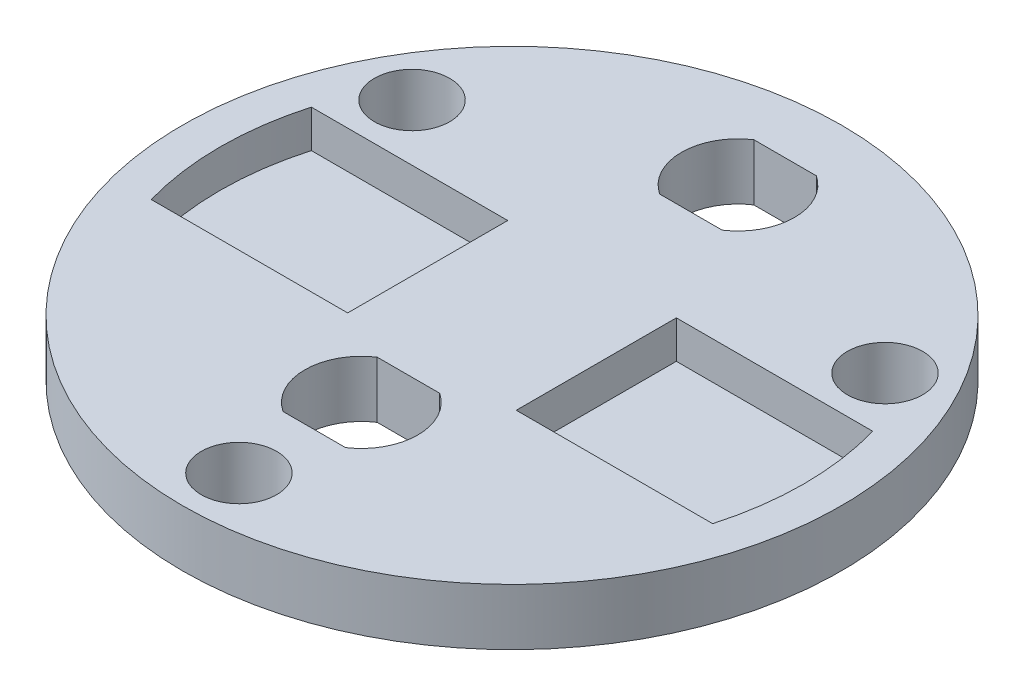
ISO-10303-21;
HEADER;
FILE_DESCRIPTION(('STEP AP214'),'2;1');
FILE_NAME('part.step','',(''),(''),'','','');
FILE_SCHEMA(('AUTOMOTIVE_DESIGN { 1 0 10303 214 1 1 1 1 }'));
ENDSEC;
DATA;
#1=APPLICATION_CONTEXT('core data for automotive mechanical design processes');
#2=APPLICATION_PROTOCOL_DEFINITION('international standard','automotive_design',2000,#1);
#3=PRODUCT_CONTEXT('',#1,'mechanical');
#4=PRODUCT('Part','Part','',(#3));
#5=PRODUCT_RELATED_PRODUCT_CATEGORY('part','',(#4));
#6=PRODUCT_DEFINITION_FORMATION('','',#4);
#7=PRODUCT_DEFINITION_CONTEXT('part definition',#1,'design');
#8=PRODUCT_DEFINITION('design','',#6,#7);
#9=PRODUCT_DEFINITION_SHAPE('','',#8);
#10=(LENGTH_UNIT() NAMED_UNIT(*) SI_UNIT(.MILLI.,.METRE.));
#11=(NAMED_UNIT(*) PLANE_ANGLE_UNIT() SI_UNIT($,.RADIAN.));
#12=(NAMED_UNIT(*) SI_UNIT($,.STERADIAN.) SOLID_ANGLE_UNIT());
#13=UNCERTAINTY_MEASURE_WITH_UNIT(LENGTH_MEASURE(1.E-05),#10,'distance_accuracy_value','');
#14=(GEOMETRIC_REPRESENTATION_CONTEXT(3) GLOBAL_UNCERTAINTY_ASSIGNED_CONTEXT((#13)) GLOBAL_UNIT_ASSIGNED_CONTEXT((#10,
#11,#12)) REPRESENTATION_CONTEXT('',''));
#15=CARTESIAN_POINT('',(0.,0.,0.));
#16=DIRECTION('',(0.,0.,1.));
#17=DIRECTION('',(1.,0.,0.));
#18=AXIS2_PLACEMENT_3D('',#15,#16,#17);
#19=CARTESIAN_POINT('',(0.,3.,0.));
#20=DIRECTION('',(0.,1.,0.));
#21=DIRECTION('',(0.,0.,1.));
#22=AXIS2_PLACEMENT_3D('',#19,#20,#21);
#23=PLANE('',#22);
#24=CARTESIAN_POINT('',(0.,3.,8.));
#25=DIRECTION('',(0.,1.,0.));
#26=DIRECTION('',(0.,0.,1.));
#27=AXIS2_PLACEMENT_3D('',#24,#25,#26);
#28=CIRCLE('',#27,3.);
#29=CARTESIAN_POINT('',(-1.6583123951777,3.,5.5));
#30=VERTEX_POINT('',#29);
#31=CARTESIAN_POINT('',(-1.6583123951777,3.,10.5));
#32=VERTEX_POINT('',#31);
#33=EDGE_CURVE('E150',#30,#32,#28,.T.);
#34=ORIENTED_EDGE('',*,*,#33,.F.);
#35=DIRECTION('',(-1.,0.,0.));
#36=VECTOR('',#35,1.);
#37=CARTESIAN_POINT('',(0.,3.,5.5));
#38=LINE('',#37,#36);
#39=CARTESIAN_POINT('',(1.6583123951777,3.,5.5));
#40=VERTEX_POINT('',#39);
#41=EDGE_CURVE('E169',#40,#30,#38,.T.);
#42=ORIENTED_EDGE('',*,*,#41,.F.);
#43=CARTESIAN_POINT('',(0.,3.,8.));
#44=DIRECTION('',(0.,1.,0.));
#45=DIRECTION('',(0.,0.,1.));
#46=AXIS2_PLACEMENT_3D('',#43,#44,#45);
#47=CIRCLE('',#46,3.);
#48=CARTESIAN_POINT('',(1.6583123951777,3.,10.5));
#49=VERTEX_POINT('',#48);
#50=EDGE_CURVE('E171',#49,#40,#47,.T.);
#51=ORIENTED_EDGE('',*,*,#50,.F.);
#52=DIRECTION('',(1.,0.,0.));
#53=VECTOR('',#52,1.);
#54=CARTESIAN_POINT('',(0.,3.,10.5));
#55=LINE('',#54,#53);
#56=EDGE_CURVE('E177',#32,#49,#55,.T.);
#57=ORIENTED_EDGE('',*,*,#56,.F.);
#58=EDGE_LOOP('',(#34,#42,#51,#57));
#59=FACE_BOUND('',#58,.T.);
#60=CARTESIAN_POINT('',(0.,3.,-12.));
#61=DIRECTION('',(0.,1.,0.));
#62=DIRECTION('',(0.,0.,1.));
#63=AXIS2_PLACEMENT_3D('',#60,#61,#62);
#64=CIRCLE('',#63,3.);
#65=CARTESIAN_POINT('',(-1.6583123951777,3.,-14.5));
#66=VERTEX_POINT('',#65);
#67=CARTESIAN_POINT('',(-1.6583123951777,3.,-9.5));
#68=VERTEX_POINT('',#67);
#69=EDGE_CURVE('E208',#66,#68,#64,.T.);
#70=ORIENTED_EDGE('',*,*,#69,.F.);
#71=DIRECTION('',(-1.,0.,0.));
#72=VECTOR('',#71,1.);
#73=CARTESIAN_POINT('',(0.,3.,-14.5));
#74=LINE('',#73,#72);
#75=CARTESIAN_POINT('',(1.6583123951777,3.,-14.5));
#76=VERTEX_POINT('',#75);
#77=EDGE_CURVE('E194',#76,#66,#74,.T.);
#78=ORIENTED_EDGE('',*,*,#77,.F.);
#79=CARTESIAN_POINT('',(0.,3.,-12.));
#80=DIRECTION('',(0.,1.,0.));
#81=DIRECTION('',(0.,0.,1.));
#82=AXIS2_PLACEMENT_3D('',#79,#80,#81);
#83=CIRCLE('',#82,3.);
#84=CARTESIAN_POINT('',(1.6583123951777,3.,-9.5));
#85=VERTEX_POINT('',#84);
#86=EDGE_CURVE('E202',#85,#76,#83,.T.);
#87=ORIENTED_EDGE('',*,*,#86,.F.);
#88=DIRECTION('',(-1.,0.,0.));
#89=VECTOR('',#88,1.);
#90=CARTESIAN_POINT('',(0.,3.,-9.5));
#91=LINE('',#90,#89);
#92=EDGE_CURVE('E205',#85,#68,#91,.T.);
#93=ORIENTED_EDGE('',*,*,#92,.T.);
#94=EDGE_LOOP('',(#70,#78,#87,#93));
#95=FACE_BOUND('',#94,.T.);
#96=CARTESIAN_POINT('',(12.5573683548743,3.,-7.25000000000006));
#97=DIRECTION('',(0.,-1.,0.));
#98=DIRECTION('',(0.,0.,-1.));
#99=AXIS2_PLACEMENT_3D('',#96,#97,#98);
#100=CIRCLE('',#99,2.);
#101=CARTESIAN_POINT('',(12.5573683548743,3.,-9.25000000000006));
#102=VERTEX_POINT('',#101);
#103=EDGE_CURVE('E210',#102,#102,#100,.T.);
#104=ORIENTED_EDGE('',*,*,#103,.T.);
#105=EDGE_LOOP('',(#104));
#106=FACE_BOUND('',#105,.T.);
#107=CARTESIAN_POINT('',(-12.5573683548743,3.,-7.25000000000006));
#108=DIRECTION('',(0.,-1.,0.));
#109=DIRECTION('',(0.,0.,-1.));
#110=AXIS2_PLACEMENT_3D('',#107,#108,#109);
#111=CIRCLE('',#110,2.);
#112=CARTESIAN_POINT('',(-12.5573683548743,3.,-9.25000000000006));
#113=VERTEX_POINT('',#112);
#114=EDGE_CURVE('E214',#113,#113,#111,.T.);
#115=ORIENTED_EDGE('',*,*,#114,.T.);
#116=EDGE_LOOP('',(#115));
#117=FACE_BOUND('',#116,.T.);
#118=CARTESIAN_POINT('',(0.,3.,14.5));
#119=DIRECTION('',(0.,-1.,0.));
#120=DIRECTION('',(0.,0.,-1.));
#121=AXIS2_PLACEMENT_3D('',#118,#119,#120);
#122=CIRCLE('',#121,2.);
#123=CARTESIAN_POINT('',(0.,3.,12.5));
#124=VERTEX_POINT('',#123);
#125=EDGE_CURVE('E223',#124,#124,#122,.T.);
#126=ORIENTED_EDGE('',*,*,#125,.T.);
#127=EDGE_LOOP('',(#126));
#128=FACE_BOUND('',#127,.T.);
#129=CARTESIAN_POINT('',(0.,3.,0.));
#130=DIRECTION('',(0.,1.,0.));
#131=DIRECTION('',(0.,0.,1.));
#132=AXIS2_PLACEMENT_3D('',#129,#130,#131);
#133=CIRCLE('',#132,15.5);
#134=CARTESIAN_POINT('',(-14.9059551857639,3.,-4.25));
#135=VERTEX_POINT('',#134);
#136=CARTESIAN_POINT('',(-14.9059551857639,3.,4.25));
#137=VERTEX_POINT('',#136);
#138=EDGE_CURVE('E277',#135,#137,#133,.T.);
#139=ORIENTED_EDGE('',*,*,#138,.F.);
#140=DIRECTION('',(1.,0.,0.));
#141=VECTOR('',#140,1.);
#142=CARTESIAN_POINT('',(0.,3.,-4.25));
#143=LINE('',#142,#141);
#144=CARTESIAN_POINT('',(-4.47608612136497,3.,-4.25));
#145=VERTEX_POINT('',#144);
#146=EDGE_CURVE('E255',#135,#145,#143,.T.);
#147=ORIENTED_EDGE('',*,*,#146,.T.);
#148=DIRECTION('',(0.,0.,-1.));
#149=VECTOR('',#148,1.);
#150=CARTESIAN_POINT('',(-4.47608612136497,3.,0.));
#151=LINE('',#150,#149);
#152=CARTESIAN_POINT('',(-4.47608612136497,3.,4.25));
#153=VERTEX_POINT('',#152);
#154=EDGE_CURVE('E265',#153,#145,#151,.T.);
#155=ORIENTED_EDGE('',*,*,#154,.F.);
#156=DIRECTION('',(1.,0.,0.));
#157=VECTOR('',#156,1.);
#158=CARTESIAN_POINT('',(0.,3.,4.25));
#159=LINE('',#158,#157);
#160=EDGE_CURVE('E280',#137,#153,#159,.T.);
#161=ORIENTED_EDGE('',*,*,#160,.F.);
#162=EDGE_LOOP('',(#139,#147,#155,#161));
#163=FACE_BOUND('',#162,.T.);
#164=CARTESIAN_POINT('',(0.,3.,0.));
#165=DIRECTION('',(0.,1.,0.));
#166=DIRECTION('',(0.,0.,1.));
#167=AXIS2_PLACEMENT_3D('',#164,#165,#166);
#168=CIRCLE('',#167,17.5);
#169=CARTESIAN_POINT('',(0.,3.,17.5));
#170=VERTEX_POINT('',#169);
#171=EDGE_CURVE('E11',#170,#170,#168,.T.);
#172=ORIENTED_EDGE('',*,*,#171,.T.);
#173=EDGE_LOOP('',(#172));
#174=FACE_BOUND('',#173,.T.);
#175=CARTESIAN_POINT('',(0.,3.,0.));
#176=DIRECTION('',(0.,1.,0.));
#177=DIRECTION('',(0.,0.,1.));
#178=AXIS2_PLACEMENT_3D('',#175,#176,#177);
#179=CIRCLE('',#178,15.5);
#180=CARTESIAN_POINT('',(14.9059551857639,3.,4.25));
#181=VERTEX_POINT('',#180);
#182=CARTESIAN_POINT('',(14.9059551857639,3.,-4.25));
#183=VERTEX_POINT('',#182);
#184=EDGE_CURVE('E244',#181,#183,#179,.T.);
#185=ORIENTED_EDGE('',*,*,#184,.F.);
#186=DIRECTION('',(-1.,0.,0.));
#187=VECTOR('',#186,1.);
#188=CARTESIAN_POINT('',(0.,3.,4.25));
#189=LINE('',#188,#187);
#190=CARTESIAN_POINT('',(4.47608612136497,3.,4.25));
#191=VERTEX_POINT('',#190);
#192=EDGE_CURVE('E226',#181,#191,#189,.T.);
#193=ORIENTED_EDGE('',*,*,#192,.T.);
#194=DIRECTION('',(0.,0.,-1.));
#195=VECTOR('',#194,1.);
#196=CARTESIAN_POINT('',(4.47608612136497,3.,0.));
#197=LINE('',#196,#195);
#198=CARTESIAN_POINT('',(4.47608612136497,3.,-4.25));
#199=VERTEX_POINT('',#198);
#200=EDGE_CURVE('E233',#191,#199,#197,.T.);
#201=ORIENTED_EDGE('',*,*,#200,.T.);
#202=DIRECTION('',(-1.,0.,0.));
#203=VECTOR('',#202,1.);
#204=CARTESIAN_POINT('',(0.,3.,-4.25));
#205=LINE('',#204,#203);
#206=EDGE_CURVE('E247',#183,#199,#205,.T.);
#207=ORIENTED_EDGE('',*,*,#206,.F.);
#208=EDGE_LOOP('',(#185,#193,#201,#207));
#209=FACE_BOUND('',#208,.T.);
#210=ADVANCED_FACE('F34',(#59,#95,#106,#117,#128,#163,#174,#209),#23,.T.);
#211=CARTESIAN_POINT('',(0.,3.,0.));
#212=DIRECTION('',(0.,-1.,0.));
#213=DIRECTION('',(0.,0.,-1.));
#214=AXIS2_PLACEMENT_3D('',#211,#212,#213);
#215=CYLINDRICAL_SURFACE('',#214,17.5);
#216=ORIENTED_EDGE('',*,*,#171,.F.);
#217=EDGE_LOOP('',(#216));
#218=FACE_BOUND('',#217,.T.);
#219=CARTESIAN_POINT('',(0.,0.,0.));
#220=DIRECTION('',(0.,1.,0.));
#221=DIRECTION('',(0.,0.,1.));
#222=AXIS2_PLACEMENT_3D('',#219,#220,#221);
#223=CIRCLE('',#222,17.5);
#224=CARTESIAN_POINT('',(0.,0.,17.5));
#225=VERTEX_POINT('',#224);
#226=EDGE_CURVE('E38',#225,#225,#223,.T.);
#227=ORIENTED_EDGE('',*,*,#226,.T.);
#228=EDGE_LOOP('',(#227));
#229=FACE_BOUND('',#228,.T.);
#230=ADVANCED_FACE('F36',(#218,#229),#215,.T.);
#231=CARTESIAN_POINT('',(0.,0.,0.));
#232=DIRECTION('',(0.,1.,0.));
#233=DIRECTION('',(0.,0.,1.));
#234=AXIS2_PLACEMENT_3D('',#231,#232,#233);
#235=PLANE('',#234);
#236=DIRECTION('',(1.,0.,0.));
#237=VECTOR('',#236,1.);
#238=CARTESIAN_POINT('',(-1.6583123951777,0.,5.5));
#239=LINE('',#238,#237);
#240=CARTESIAN_POINT('',(-1.6583123951777,0.,5.5));
#241=VERTEX_POINT('',#240);
#242=CARTESIAN_POINT('',(1.6583123951777,0.,5.5));
#243=VERTEX_POINT('',#242);
#244=EDGE_CURVE('E168',#241,#243,#239,.T.);
#245=ORIENTED_EDGE('',*,*,#244,.F.);
#246=CARTESIAN_POINT('',(0.,0.,8.));
#247=DIRECTION('',(0.,-1.,0.));
#248=DIRECTION('',(0.,0.,-1.));
#249=AXIS2_PLACEMENT_3D('',#246,#247,#248);
#250=CIRCLE('',#249,3.);
#251=CARTESIAN_POINT('',(-1.6583123951777,0.,10.5));
#252=VERTEX_POINT('',#251);
#253=EDGE_CURVE('E57',#252,#241,#250,.T.);
#254=ORIENTED_EDGE('',*,*,#253,.F.);
#255=DIRECTION('',(-1.,0.,0.));
#256=VECTOR('',#255,1.);
#257=CARTESIAN_POINT('',(1.6583123951777,0.,10.5));
#258=LINE('',#257,#256);
#259=CARTESIAN_POINT('',(1.6583123951777,0.,10.5));
#260=VERTEX_POINT('',#259);
#261=EDGE_CURVE('E156',#260,#252,#258,.T.);
#262=ORIENTED_EDGE('',*,*,#261,.F.);
#263=CARTESIAN_POINT('',(0.,0.,8.));
#264=DIRECTION('',(0.,-1.,0.));
#265=DIRECTION('',(0.,0.,-1.));
#266=AXIS2_PLACEMENT_3D('',#263,#264,#265);
#267=CIRCLE('',#266,3.);
#268=EDGE_CURVE('E162',#243,#260,#267,.T.);
#269=ORIENTED_EDGE('',*,*,#268,.F.);
#270=EDGE_LOOP('',(#245,#254,#262,#269));
#271=FACE_BOUND('',#270,.T.);
#272=DIRECTION('',(1.,0.,0.));
#273=VECTOR('',#272,1.);
#274=CARTESIAN_POINT('',(-1.6583123951777,0.,-14.5));
#275=LINE('',#274,#273);
#276=CARTESIAN_POINT('',(-1.6583123951777,0.,-14.5));
#277=VERTEX_POINT('',#276);
#278=CARTESIAN_POINT('',(1.6583123951777,0.,-14.5));
#279=VERTEX_POINT('',#278);
#280=EDGE_CURVE('E182',#277,#279,#275,.T.);
#281=ORIENTED_EDGE('',*,*,#280,.F.);
#282=CARTESIAN_POINT('',(0.,0.,-12.));
#283=DIRECTION('',(0.,-1.,0.));
#284=DIRECTION('',(0.,0.,-1.));
#285=AXIS2_PLACEMENT_3D('',#282,#283,#284);
#286=CIRCLE('',#285,3.);
#287=CARTESIAN_POINT('',(-1.6583123951777,0.,-9.5));
#288=VERTEX_POINT('',#287);
#289=EDGE_CURVE('E180',#288,#277,#286,.T.);
#290=ORIENTED_EDGE('',*,*,#289,.F.);
#291=DIRECTION('',(1.,0.,0.));
#292=VECTOR('',#291,1.);
#293=CARTESIAN_POINT('',(-1.6583123951777,0.,-9.5));
#294=LINE('',#293,#292);
#295=CARTESIAN_POINT('',(1.6583123951777,0.,-9.5));
#296=VERTEX_POINT('',#295);
#297=EDGE_CURVE('E188',#288,#296,#294,.T.);
#298=ORIENTED_EDGE('',*,*,#297,.T.);
#299=CARTESIAN_POINT('',(0.,0.,-12.));
#300=DIRECTION('',(0.,-1.,0.));
#301=DIRECTION('',(0.,0.,-1.));
#302=AXIS2_PLACEMENT_3D('',#299,#300,#301);
#303=CIRCLE('',#302,3.);
#304=EDGE_CURVE('E185',#279,#296,#303,.T.);
#305=ORIENTED_EDGE('',*,*,#304,.F.);
#306=EDGE_LOOP('',(#281,#290,#298,#305));
#307=FACE_BOUND('',#306,.T.);
#308=CARTESIAN_POINT('',(12.5573683548743,0.,-7.25000000000006));
#309=DIRECTION('',(0.,-1.,0.));
#310=DIRECTION('',(0.,0.,-1.));
#311=AXIS2_PLACEMENT_3D('',#308,#309,#310);
#312=CIRCLE('',#311,2.);
#313=CARTESIAN_POINT('',(12.5573683548743,0.,-9.25000000000006));
#314=VERTEX_POINT('',#313);
#315=EDGE_CURVE('E211',#314,#314,#312,.T.);
#316=ORIENTED_EDGE('',*,*,#315,.F.);
#317=EDGE_LOOP('',(#316));
#318=FACE_BOUND('',#317,.T.);
#319=CARTESIAN_POINT('',(-12.5573683548743,0.,-7.25000000000006));
#320=DIRECTION('',(0.,-1.,0.));
#321=DIRECTION('',(0.,0.,-1.));
#322=AXIS2_PLACEMENT_3D('',#319,#320,#321);
#323=CIRCLE('',#322,2.);
#324=CARTESIAN_POINT('',(-12.5573683548743,0.,-9.25000000000006));
#325=VERTEX_POINT('',#324);
#326=EDGE_CURVE('E217',#325,#325,#323,.T.);
#327=ORIENTED_EDGE('',*,*,#326,.F.);
#328=EDGE_LOOP('',(#327));
#329=FACE_BOUND('',#328,.T.);
#330=CARTESIAN_POINT('',(0.,0.,14.5));
#331=DIRECTION('',(0.,-1.,0.));
#332=DIRECTION('',(0.,0.,-1.));
#333=AXIS2_PLACEMENT_3D('',#330,#331,#332);
#334=CIRCLE('',#333,2.);
#335=CARTESIAN_POINT('',(0.,0.,12.5));
#336=VERTEX_POINT('',#335);
#337=EDGE_CURVE('E220',#336,#336,#334,.T.);
#338=ORIENTED_EDGE('',*,*,#337,.F.);
#339=EDGE_LOOP('',(#338));
#340=FACE_BOUND('',#339,.T.);
#341=ORIENTED_EDGE('',*,*,#226,.F.);
#342=EDGE_LOOP('',(#341));
#343=FACE_BOUND('',#342,.T.);
#344=ADVANCED_FACE('F166',(#271,#307,#318,#329,#340,#343),#235,.F.);
#345=CARTESIAN_POINT('',(0.,1.,-4.25));
#346=DIRECTION('',(0.,0.,1.));
#347=DIRECTION('',(1.,0.,0.));
#348=AXIS2_PLACEMENT_3D('',#345,#346,#347);
#349=PLANE('',#348);
#350=ORIENTED_EDGE('',*,*,#146,.F.);
#351=DIRECTION('',(0.,1.,0.));
#352=VECTOR('',#351,1.);
#353=CARTESIAN_POINT('',(-14.9059551857639,1.,-4.25));
#354=LINE('',#353,#352);
#355=CARTESIAN_POINT('',(-14.9059551857639,1.,-4.25));
#356=VERTEX_POINT('',#355);
#357=EDGE_CURVE('E274',#356,#135,#354,.T.);
#358=ORIENTED_EDGE('',*,*,#357,.F.);
#359=DIRECTION('',(1.,0.,0.));
#360=VECTOR('',#359,1.);
#361=CARTESIAN_POINT('',(0.,1.,-4.25));
#362=LINE('',#361,#360);
#363=CARTESIAN_POINT('',(-4.47608612136497,1.,-4.25));
#364=VERTEX_POINT('',#363);
#365=EDGE_CURVE('E262',#356,#364,#362,.T.);
#366=ORIENTED_EDGE('',*,*,#365,.T.);
#367=DIRECTION('',(0.,1.,0.));
#368=VECTOR('',#367,1.);
#369=CARTESIAN_POINT('',(-4.47608612136497,1.,-4.25));
#370=LINE('',#369,#368);
#371=EDGE_CURVE('E285',#364,#145,#370,.T.);
#372=ORIENTED_EDGE('',*,*,#371,.T.);
#373=EDGE_LOOP('',(#350,#358,#366,#372));
#374=FACE_BOUND('',#373,.T.);
#375=ADVANCED_FACE('F309',(#374),#349,.T.);
#376=CARTESIAN_POINT('',(-4.47608612136497,1.,0.));
#377=DIRECTION('',(1.,0.,0.));
#378=DIRECTION('',(0.,0.,-1.));
#379=AXIS2_PLACEMENT_3D('',#376,#377,#378);
#380=PLANE('',#379);
#381=ORIENTED_EDGE('',*,*,#154,.T.);
#382=ORIENTED_EDGE('',*,*,#371,.F.);
#383=DIRECTION('',(0.,0.,-1.));
#384=VECTOR('',#383,1.);
#385=CARTESIAN_POINT('',(-4.47608612136497,1.,0.));
#386=LINE('',#385,#384);
#387=CARTESIAN_POINT('',(-4.47608612136497,1.,4.25));
#388=VERTEX_POINT('',#387);
#389=EDGE_CURVE('E271',#388,#364,#386,.T.);
#390=ORIENTED_EDGE('',*,*,#389,.F.);
#391=DIRECTION('',(0.,1.,0.));
#392=VECTOR('',#391,1.);
#393=CARTESIAN_POINT('',(-4.47608612136497,1.,4.25));
#394=LINE('',#393,#392);
#395=EDGE_CURVE('E287',#388,#153,#394,.T.);
#396=ORIENTED_EDGE('',*,*,#395,.T.);
#397=EDGE_LOOP('',(#381,#382,#390,#396));
#398=FACE_BOUND('',#397,.T.);
#399=ADVANCED_FACE('F311',(#398),#380,.F.);
#400=CARTESIAN_POINT('',(0.,1.,4.25));
#401=DIRECTION('',(0.,0.,1.));
#402=DIRECTION('',(1.,0.,0.));
#403=AXIS2_PLACEMENT_3D('',#400,#401,#402);
#404=PLANE('',#403);
#405=ORIENTED_EDGE('',*,*,#160,.T.);
#406=ORIENTED_EDGE('',*,*,#395,.F.);
#407=DIRECTION('',(1.,0.,0.));
#408=VECTOR('',#407,1.);
#409=CARTESIAN_POINT('',(0.,1.,4.25));
#410=LINE('',#409,#408);
#411=CARTESIAN_POINT('',(-14.9059551857639,1.,4.25));
#412=VERTEX_POINT('',#411);
#413=EDGE_CURVE('E268',#412,#388,#410,.T.);
#414=ORIENTED_EDGE('',*,*,#413,.F.);
#415=DIRECTION('',(0.,1.,0.));
#416=VECTOR('',#415,1.);
#417=CARTESIAN_POINT('',(-14.9059551857639,1.,4.25));
#418=LINE('',#417,#416);
#419=EDGE_CURVE('E289',#412,#137,#418,.T.);
#420=ORIENTED_EDGE('',*,*,#419,.T.);
#421=EDGE_LOOP('',(#405,#406,#414,#420));
#422=FACE_BOUND('',#421,.T.);
#423=ADVANCED_FACE('F303',(#422),#404,.F.);
#424=CARTESIAN_POINT('',(0.,1.,0.));
#425=DIRECTION('',(0.,1.,0.));
#426=DIRECTION('',(0.,0.,1.));
#427=AXIS2_PLACEMENT_3D('',#424,#425,#426);
#428=CYLINDRICAL_SURFACE('',#427,15.5);
#429=ORIENTED_EDGE('',*,*,#138,.T.);
#430=ORIENTED_EDGE('',*,*,#419,.F.);
#431=CARTESIAN_POINT('',(0.,1.,0.));
#432=DIRECTION('',(0.,1.,0.));
#433=DIRECTION('',(0.,0.,1.));
#434=AXIS2_PLACEMENT_3D('',#431,#432,#433);
#435=CIRCLE('',#434,15.5);
#436=EDGE_CURVE('E264',#356,#412,#435,.T.);
#437=ORIENTED_EDGE('',*,*,#436,.F.);
#438=ORIENTED_EDGE('',*,*,#357,.T.);
#439=EDGE_LOOP('',(#429,#430,#437,#438));
#440=FACE_BOUND('',#439,.T.);
#441=ADVANCED_FACE('F295',(#440),#428,.F.);
#442=CARTESIAN_POINT('',(0.,1.,0.));
#443=DIRECTION('',(0.,1.,0.));
#444=DIRECTION('',(0.,0.,1.));
#445=AXIS2_PLACEMENT_3D('',#442,#443,#444);
#446=PLANE('',#445);
#447=ORIENTED_EDGE('',*,*,#365,.F.);
#448=ORIENTED_EDGE('',*,*,#436,.T.);
#449=ORIENTED_EDGE('',*,*,#413,.T.);
#450=ORIENTED_EDGE('',*,*,#389,.T.);
#451=EDGE_LOOP('',(#447,#448,#449,#450));
#452=FACE_BOUND('',#451,.T.);
#453=ADVANCED_FACE('F307',(#452),#446,.T.);
#454=CARTESIAN_POINT('',(0.,1.,4.25));
#455=DIRECTION('',(0.,0.,-1.));
#456=DIRECTION('',(-1.,0.,0.));
#457=AXIS2_PLACEMENT_3D('',#454,#455,#456);
#458=PLANE('',#457);
#459=ORIENTED_EDGE('',*,*,#192,.F.);
#460=DIRECTION('',(0.,1.,0.));
#461=VECTOR('',#460,1.);
#462=CARTESIAN_POINT('',(14.9059551857639,1.,4.25));
#463=LINE('',#462,#461);
#464=CARTESIAN_POINT('',(14.9059551857639,1.,4.25));
#465=VERTEX_POINT('',#464);
#466=EDGE_CURVE('E241',#465,#181,#463,.T.);
#467=ORIENTED_EDGE('',*,*,#466,.F.);
#468=DIRECTION('',(-1.,0.,0.));
#469=VECTOR('',#468,1.);
#470=CARTESIAN_POINT('',(0.,1.,4.25));
#471=LINE('',#470,#469);
#472=CARTESIAN_POINT('',(4.47608612136497,1.,4.25));
#473=VERTEX_POINT('',#472);
#474=EDGE_CURVE('E229',#465,#473,#471,.T.);
#475=ORIENTED_EDGE('',*,*,#474,.T.);
#476=DIRECTION('',(0.,1.,0.));
#477=VECTOR('',#476,1.);
#478=CARTESIAN_POINT('',(4.47608612136497,1.,4.25));
#479=LINE('',#478,#477);
#480=EDGE_CURVE('E252',#473,#191,#479,.T.);
#481=ORIENTED_EDGE('',*,*,#480,.T.);
#482=EDGE_LOOP('',(#459,#467,#475,#481));
#483=FACE_BOUND('',#482,.T.);
#484=ADVANCED_FACE('F370',(#483),#458,.T.);
#485=CARTESIAN_POINT('',(4.47608612136497,1.,0.));
#486=DIRECTION('',(1.,0.,0.));
#487=DIRECTION('',(0.,0.,-1.));
#488=AXIS2_PLACEMENT_3D('',#485,#486,#487);
#489=PLANE('',#488);
#490=ORIENTED_EDGE('',*,*,#200,.F.);
#491=ORIENTED_EDGE('',*,*,#480,.F.);
#492=DIRECTION('',(0.,0.,-1.));
#493=VECTOR('',#492,1.);
#494=CARTESIAN_POINT('',(4.47608612136497,1.,0.));
#495=LINE('',#494,#493);
#496=CARTESIAN_POINT('',(4.47608612136497,1.,-4.25));
#497=VERTEX_POINT('',#496);
#498=EDGE_CURVE('E239',#473,#497,#495,.T.);
#499=ORIENTED_EDGE('',*,*,#498,.T.);
#500=DIRECTION('',(0.,1.,0.));
#501=VECTOR('',#500,1.);
#502=CARTESIAN_POINT('',(4.47608612136497,1.,-4.25));
#503=LINE('',#502,#501);
#504=EDGE_CURVE('E256',#497,#199,#503,.T.);
#505=ORIENTED_EDGE('',*,*,#504,.T.);
#506=EDGE_LOOP('',(#490,#491,#499,#505));
#507=FACE_BOUND('',#506,.T.);
#508=ADVANCED_FACE('F378',(#507),#489,.T.);
#509=CARTESIAN_POINT('',(0.,1.,-4.25));
#510=DIRECTION('',(0.,0.,-1.));
#511=DIRECTION('',(-1.,0.,0.));
#512=AXIS2_PLACEMENT_3D('',#509,#510,#511);
#513=PLANE('',#512);
#514=ORIENTED_EDGE('',*,*,#206,.T.);
#515=ORIENTED_EDGE('',*,*,#504,.F.);
#516=DIRECTION('',(-1.,0.,0.));
#517=VECTOR('',#516,1.);
#518=CARTESIAN_POINT('',(0.,1.,-4.25));
#519=LINE('',#518,#517);
#520=CARTESIAN_POINT('',(14.9059551857639,1.,-4.25));
#521=VERTEX_POINT('',#520);
#522=EDGE_CURVE('E236',#521,#497,#519,.T.);
#523=ORIENTED_EDGE('',*,*,#522,.F.);
#524=DIRECTION('',(0.,1.,0.));
#525=VECTOR('',#524,1.);
#526=CARTESIAN_POINT('',(14.9059551857639,1.,-4.25));
#527=LINE('',#526,#525);
#528=EDGE_CURVE('E258',#521,#183,#527,.T.);
#529=ORIENTED_EDGE('',*,*,#528,.T.);
#530=EDGE_LOOP('',(#514,#515,#523,#529));
#531=FACE_BOUND('',#530,.T.);
#532=ADVANCED_FACE('F388',(#531),#513,.F.);
#533=CARTESIAN_POINT('',(0.,1.,0.));
#534=DIRECTION('',(0.,1.,0.));
#535=DIRECTION('',(0.,0.,1.));
#536=AXIS2_PLACEMENT_3D('',#533,#534,#535);
#537=CYLINDRICAL_SURFACE('',#536,15.5);
#538=ORIENTED_EDGE('',*,*,#184,.T.);
#539=ORIENTED_EDGE('',*,*,#528,.F.);
#540=CARTESIAN_POINT('',(0.,1.,0.));
#541=DIRECTION('',(0.,1.,0.));
#542=DIRECTION('',(0.,0.,1.));
#543=AXIS2_PLACEMENT_3D('',#540,#541,#542);
#544=CIRCLE('',#543,15.5);
#545=EDGE_CURVE('E232',#465,#521,#544,.T.);
#546=ORIENTED_EDGE('',*,*,#545,.F.);
#547=ORIENTED_EDGE('',*,*,#466,.T.);
#548=EDGE_LOOP('',(#538,#539,#546,#547));
#549=FACE_BOUND('',#548,.T.);
#550=ADVANCED_FACE('F398',(#549),#537,.F.);
#551=CARTESIAN_POINT('',(0.,1.,0.));
#552=DIRECTION('',(0.,1.,0.));
#553=DIRECTION('',(0.,0.,1.));
#554=AXIS2_PLACEMENT_3D('',#551,#552,#553);
#555=PLANE('',#554);
#556=ORIENTED_EDGE('',*,*,#474,.F.);
#557=ORIENTED_EDGE('',*,*,#545,.T.);
#558=ORIENTED_EDGE('',*,*,#522,.T.);
#559=ORIENTED_EDGE('',*,*,#498,.F.);
#560=EDGE_LOOP('',(#556,#557,#558,#559));
#561=FACE_BOUND('',#560,.T.);
#562=ADVANCED_FACE('F408',(#561),#555,.T.);
#563=CARTESIAN_POINT('',(0.,3.,14.5));
#564=DIRECTION('',(0.,-1.,0.));
#565=DIRECTION('',(0.,0.,-1.));
#566=AXIS2_PLACEMENT_3D('',#563,#564,#565);
#567=CYLINDRICAL_SURFACE('',#566,2.);
#568=ORIENTED_EDGE('',*,*,#125,.F.);
#569=EDGE_LOOP('',(#568));
#570=FACE_BOUND('',#569,.T.);
#571=ORIENTED_EDGE('',*,*,#337,.T.);
#572=EDGE_LOOP('',(#571));
#573=FACE_BOUND('',#572,.T.);
#574=ADVANCED_FACE('F418',(#570,#573),#567,.F.);
#575=CARTESIAN_POINT('',(-12.5573683548743,3.,-7.25000000000006));
#576=DIRECTION('',(0.,-1.,0.));
#577=DIRECTION('',(0.,0.,-1.));
#578=AXIS2_PLACEMENT_3D('',#575,#576,#577);
#579=CYLINDRICAL_SURFACE('',#578,2.);
#580=ORIENTED_EDGE('',*,*,#114,.F.);
#581=EDGE_LOOP('',(#580));
#582=FACE_BOUND('',#581,.T.);
#583=ORIENTED_EDGE('',*,*,#326,.T.);
#584=EDGE_LOOP('',(#583));
#585=FACE_BOUND('',#584,.T.);
#586=ADVANCED_FACE('F428',(#582,#585),#579,.F.);
#587=CARTESIAN_POINT('',(12.5573683548743,3.,-7.25000000000006));
#588=DIRECTION('',(0.,-1.,0.));
#589=DIRECTION('',(0.,0.,-1.));
#590=AXIS2_PLACEMENT_3D('',#587,#588,#589);
#591=CYLINDRICAL_SURFACE('',#590,2.);
#592=ORIENTED_EDGE('',*,*,#103,.F.);
#593=EDGE_LOOP('',(#592));
#594=FACE_BOUND('',#593,.T.);
#595=ORIENTED_EDGE('',*,*,#315,.T.);
#596=EDGE_LOOP('',(#595));
#597=FACE_BOUND('',#596,.T.);
#598=ADVANCED_FACE('F438',(#594,#597),#591,.F.);
#599=CARTESIAN_POINT('',(0.,10.,-12.));
#600=DIRECTION('',(0.,-1.,0.));
#601=DIRECTION('',(0.,0.,-1.));
#602=AXIS2_PLACEMENT_3D('',#599,#600,#601);
#603=CYLINDRICAL_SURFACE('',#602,3.);
#604=ORIENTED_EDGE('',*,*,#69,.T.);
#605=DIRECTION('',(0.,-1.,0.));
#606=VECTOR('',#605,1.);
#607=CARTESIAN_POINT('',(-1.6583123951777,10.,-9.5));
#608=LINE('',#607,#606);
#609=EDGE_CURVE('E192',#68,#288,#608,.T.);
#610=ORIENTED_EDGE('',*,*,#609,.T.);
#611=ORIENTED_EDGE('',*,*,#289,.T.);
#612=DIRECTION('',(0.,-1.,0.));
#613=VECTOR('',#612,1.);
#614=CARTESIAN_POINT('',(-1.6583123951777,10.,-14.5));
#615=LINE('',#614,#613);
#616=EDGE_CURVE('E191',#66,#277,#615,.T.);
#617=ORIENTED_EDGE('',*,*,#616,.F.);
#618=EDGE_LOOP('',(#604,#610,#611,#617));
#619=FACE_BOUND('',#618,.T.);
#620=ADVANCED_FACE('F447',(#619),#603,.F.);
#621=CARTESIAN_POINT('',(-1.6583123951777,10.,-9.5));
#622=DIRECTION('',(0.,0.,-1.));
#623=DIRECTION('',(-1.,0.,0.));
#624=AXIS2_PLACEMENT_3D('',#621,#622,#623);
#625=PLANE('',#624);
#626=DIRECTION('',(0.,-1.,0.));
#627=VECTOR('',#626,1.);
#628=CARTESIAN_POINT('',(1.6583123951777,10.,-9.5));
#629=LINE('',#628,#627);
#630=EDGE_CURVE('E195',#85,#296,#629,.T.);
#631=ORIENTED_EDGE('',*,*,#630,.T.);
#632=ORIENTED_EDGE('',*,*,#297,.F.);
#633=ORIENTED_EDGE('',*,*,#609,.F.);
#634=ORIENTED_EDGE('',*,*,#92,.F.);
#635=EDGE_LOOP('',(#631,#632,#633,#634));
#636=FACE_BOUND('',#635,.T.);
#637=ADVANCED_FACE('F464',(#636),#625,.T.);
#638=CARTESIAN_POINT('',(0.,10.,-12.));
#639=DIRECTION('',(0.,-1.,0.));
#640=DIRECTION('',(0.,0.,-1.));
#641=AXIS2_PLACEMENT_3D('',#638,#639,#640);
#642=CYLINDRICAL_SURFACE('',#641,3.);
#643=ORIENTED_EDGE('',*,*,#86,.T.);
#644=DIRECTION('',(0.,-1.,0.));
#645=VECTOR('',#644,1.);
#646=CARTESIAN_POINT('',(1.6583123951777,10.,-14.5));
#647=LINE('',#646,#645);
#648=EDGE_CURVE('E197',#76,#279,#647,.T.);
#649=ORIENTED_EDGE('',*,*,#648,.T.);
#650=ORIENTED_EDGE('',*,*,#304,.T.);
#651=ORIENTED_EDGE('',*,*,#630,.F.);
#652=EDGE_LOOP('',(#643,#649,#650,#651));
#653=FACE_BOUND('',#652,.T.);
#654=ADVANCED_FACE('F471',(#653),#642,.F.);
#655=CARTESIAN_POINT('',(-1.6583123951777,10.,-14.5));
#656=DIRECTION('',(0.,0.,-1.));
#657=DIRECTION('',(-1.,0.,0.));
#658=AXIS2_PLACEMENT_3D('',#655,#656,#657);
#659=PLANE('',#658);
#660=ORIENTED_EDGE('',*,*,#77,.T.);
#661=ORIENTED_EDGE('',*,*,#616,.T.);
#662=ORIENTED_EDGE('',*,*,#280,.T.);
#663=ORIENTED_EDGE('',*,*,#648,.F.);
#664=EDGE_LOOP('',(#660,#661,#662,#663));
#665=FACE_BOUND('',#664,.T.);
#666=ADVANCED_FACE('F479',(#665),#659,.F.);
#667=CARTESIAN_POINT('',(0.,10.,8.));
#668=DIRECTION('',(0.,-1.,0.));
#669=DIRECTION('',(0.,0.,-1.));
#670=AXIS2_PLACEMENT_3D('',#667,#668,#669);
#671=CYLINDRICAL_SURFACE('',#670,3.);
#672=ORIENTED_EDGE('',*,*,#33,.T.);
#673=DIRECTION('',(0.,-1.,0.));
#674=VECTOR('',#673,1.);
#675=CARTESIAN_POINT('',(-1.6583123951777,10.,10.5));
#676=LINE('',#675,#674);
#677=EDGE_CURVE('E146',#32,#252,#676,.T.);
#678=ORIENTED_EDGE('',*,*,#677,.T.);
#679=ORIENTED_EDGE('',*,*,#253,.T.);
#680=DIRECTION('',(0.,-1.,0.));
#681=VECTOR('',#680,1.);
#682=CARTESIAN_POINT('',(-1.6583123951777,10.,5.5));
#683=LINE('',#682,#681);
#684=EDGE_CURVE('E163',#30,#241,#683,.T.);
#685=ORIENTED_EDGE('',*,*,#684,.F.);
#686=EDGE_LOOP('',(#672,#678,#679,#685));
#687=FACE_BOUND('',#686,.T.);
#688=ADVANCED_FACE('F148',(#687),#671,.F.);
#689=CARTESIAN_POINT('',(1.6583123951777,10.,10.5));
#690=DIRECTION('',(0.,0.,1.));
#691=DIRECTION('',(1.,0.,0.));
#692=AXIS2_PLACEMENT_3D('',#689,#690,#691);
#693=PLANE('',#692);
#694=ORIENTED_EDGE('',*,*,#56,.T.);
#695=DIRECTION('',(0.,-1.,0.));
#696=VECTOR('',#695,1.);
#697=CARTESIAN_POINT('',(1.6583123951777,10.,10.5));
#698=LINE('',#697,#696);
#699=EDGE_CURVE('E153',#49,#260,#698,.T.);
#700=ORIENTED_EDGE('',*,*,#699,.T.);
#701=ORIENTED_EDGE('',*,*,#261,.T.);
#702=ORIENTED_EDGE('',*,*,#677,.F.);
#703=EDGE_LOOP('',(#694,#700,#701,#702));
#704=FACE_BOUND('',#703,.T.);
#705=ADVANCED_FACE('F157',(#704),#693,.F.);
#706=CARTESIAN_POINT('',(0.,10.,8.));
#707=DIRECTION('',(0.,-1.,0.));
#708=DIRECTION('',(0.,0.,-1.));
#709=AXIS2_PLACEMENT_3D('',#706,#707,#708);
#710=CYLINDRICAL_SURFACE('',#709,3.);
#711=ORIENTED_EDGE('',*,*,#50,.T.);
#712=DIRECTION('',(0.,-1.,0.));
#713=VECTOR('',#712,1.);
#714=CARTESIAN_POINT('',(1.6583123951777,10.,5.5));
#715=LINE('',#714,#713);
#716=EDGE_CURVE('E49',#40,#243,#715,.T.);
#717=ORIENTED_EDGE('',*,*,#716,.T.);
#718=ORIENTED_EDGE('',*,*,#268,.T.);
#719=ORIENTED_EDGE('',*,*,#699,.F.);
#720=EDGE_LOOP('',(#711,#717,#718,#719));
#721=FACE_BOUND('',#720,.T.);
#722=ADVANCED_FACE('F500',(#721),#710,.F.);
#723=CARTESIAN_POINT('',(-1.6583123951777,10.,5.5));
#724=DIRECTION('',(0.,0.,-1.));
#725=DIRECTION('',(-1.,0.,0.));
#726=AXIS2_PLACEMENT_3D('',#723,#724,#725);
#727=PLANE('',#726);
#728=ORIENTED_EDGE('',*,*,#41,.T.);
#729=ORIENTED_EDGE('',*,*,#684,.T.);
#730=ORIENTED_EDGE('',*,*,#244,.T.);
#731=ORIENTED_EDGE('',*,*,#716,.F.);
#732=EDGE_LOOP('',(#728,#729,#730,#731));
#733=FACE_BOUND('',#732,.T.);
#734=ADVANCED_FACE('F507',(#733),#727,.F.);
#735=CLOSED_SHELL('',(#210,#230,#344,#375,#399,#423,#441,#453,#484,#508,#532,#550,#562,#574,
#586,#598,#620,#637,#654,#666,#688,#705,#722,#734));
#736=MANIFOLD_SOLID_BREP('B2',#735);
#737=ADVANCED_BREP_SHAPE_REPRESENTATION('',(#18,#736),#14);
#738=SHAPE_DEFINITION_REPRESENTATION(#9,#737);
ENDSEC;
END-ISO-10303-21;
